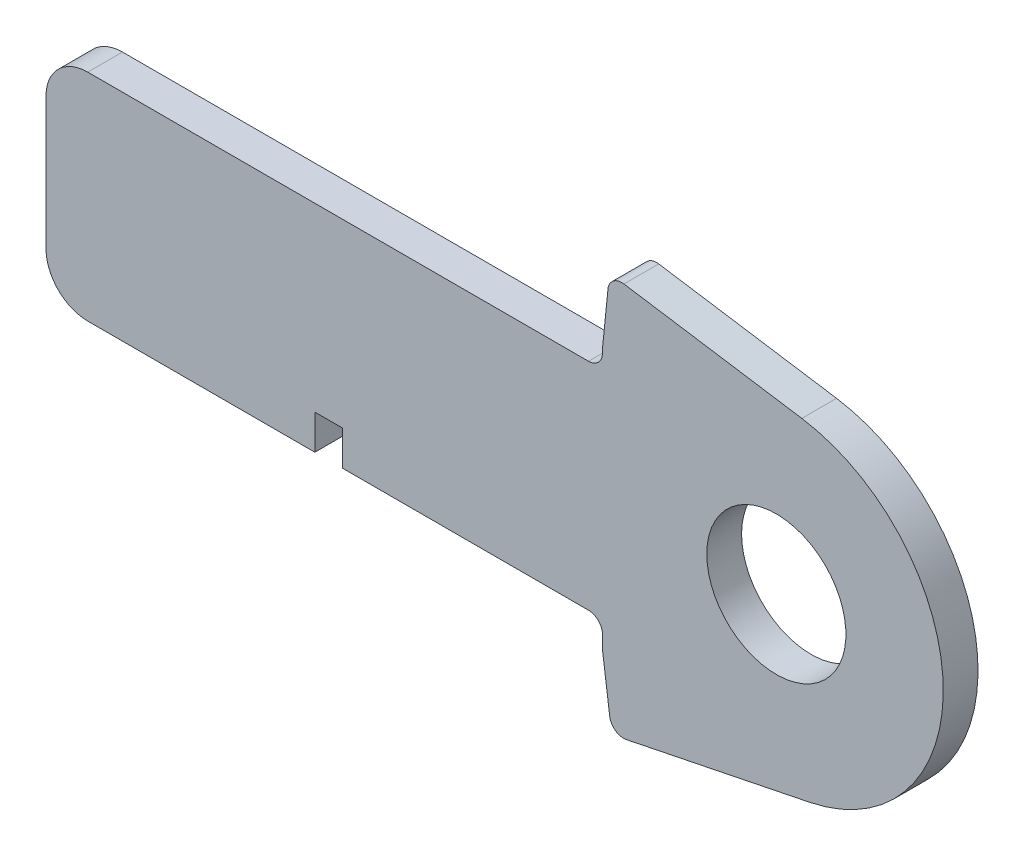
ISO-10303-21;
HEADER;
FILE_DESCRIPTION(('STEP AP214'),'2;1');
FILE_NAME('part.step','',(''),(''),'','','');
FILE_SCHEMA(('AUTOMOTIVE_DESIGN { 1 0 10303 214 1 1 1 1 }'));
ENDSEC;
DATA;
#1=APPLICATION_CONTEXT('core data for automotive mechanical design processes');
#2=APPLICATION_PROTOCOL_DEFINITION('international standard','automotive_design',2000,#1);
#3=PRODUCT_CONTEXT('',#1,'mechanical');
#4=PRODUCT('Part','Part','',(#3));
#5=PRODUCT_RELATED_PRODUCT_CATEGORY('part','',(#4));
#6=PRODUCT_DEFINITION_FORMATION('','',#4);
#7=PRODUCT_DEFINITION_CONTEXT('part definition',#1,'design');
#8=PRODUCT_DEFINITION('design','',#6,#7);
#9=PRODUCT_DEFINITION_SHAPE('','',#8);
#10=(LENGTH_UNIT() NAMED_UNIT(*) SI_UNIT(.MILLI.,.METRE.));
#11=(NAMED_UNIT(*) PLANE_ANGLE_UNIT() SI_UNIT($,.RADIAN.));
#12=(NAMED_UNIT(*) SI_UNIT($,.STERADIAN.) SOLID_ANGLE_UNIT());
#13=UNCERTAINTY_MEASURE_WITH_UNIT(LENGTH_MEASURE(1.E-05),#10,'distance_accuracy_value','');
#14=(GEOMETRIC_REPRESENTATION_CONTEXT(3) GLOBAL_UNCERTAINTY_ASSIGNED_CONTEXT((#13)) GLOBAL_UNIT_ASSIGNED_CONTEXT((#10,
#11,#12)) REPRESENTATION_CONTEXT('',''));
#15=CARTESIAN_POINT('',(0.,0.,0.));
#16=DIRECTION('',(0.,0.,1.));
#17=DIRECTION('',(1.,0.,0.));
#18=AXIS2_PLACEMENT_3D('',#15,#16,#17);
#19=CARTESIAN_POINT('',(213.422580288689,54.7287513036553,-3.175));
#20=DIRECTION('',(0.,0.,1.));
#21=DIRECTION('',(-1.,0.,0.));
#22=AXIS2_PLACEMENT_3D('',#19,#20,#21);
#23=PLANE('',#22);
#24=CARTESIAN_POINT('',(292.383806587551,26.255421434861,-3.175));
#25=DIRECTION('',(0.,0.,-1.));
#26=DIRECTION('',(-1.,0.,0.));
#27=AXIS2_PLACEMENT_3D('',#24,#25,#26);
#28=CIRCLE('',#27,6.35);
#29=CARTESIAN_POINT('',(286.033806587551,26.255421434861,-3.175));
#30=VERTEX_POINT('',#29);
#31=EDGE_CURVE('E276',#30,#30,#28,.T.);
#32=ORIENTED_EDGE('',*,*,#31,.F.);
#33=EDGE_LOOP('',(#32));
#34=FACE_BOUND('',#33,.T.);
#35=DIRECTION('',(-0.133331034869946,0.991071559041278,0.));
#36=VECTOR('',#35,1.);
#37=CARTESIAN_POINT('',(273.434595269181,36.7857570161253,-3.175));
#38=LINE('',#37,#36);
#39=CARTESIAN_POINT('',(277.174368657139,8.98740499943636,-3.175));
#40=VERTEX_POINT('',#39);
#41=CARTESIAN_POINT('',(276.508806587551,13.9346375667709,-3.175));
#42=VERTEX_POINT('',#41);
#43=EDGE_CURVE('E228',#40,#42,#38,.T.);
#44=ORIENTED_EDGE('',*,*,#43,.T.);
#45=DIRECTION('',(0.,1.,0.));
#46=VECTOR('',#45,1.);
#47=CARTESIAN_POINT('',(276.508806587551,0.,-3.175));
#48=LINE('',#47,#46);
#49=CARTESIAN_POINT('',(276.508806587551,15.142921434861,-3.175));
#50=VERTEX_POINT('',#49);
#51=EDGE_CURVE('E231',#42,#50,#48,.T.);
#52=ORIENTED_EDGE('',*,*,#51,.T.);
#53=CARTESIAN_POINT('',(275.238806587551,15.142921434861,-3.175));
#54=DIRECTION('',(0.,0.,-1.));
#55=DIRECTION('',(-1.,0.,0.));
#56=AXIS2_PLACEMENT_3D('',#53,#54,#55);
#57=CIRCLE('',#56,1.27);
#58=CARTESIAN_POINT('',(275.238806587551,16.412921434861,-3.175));
#59=VERTEX_POINT('',#58);
#60=EDGE_CURVE('E325',#59,#50,#57,.T.);
#61=ORIENTED_EDGE('',*,*,#60,.F.);
#62=DIRECTION('',(1.,0.,0.));
#63=VECTOR('',#62,1.);
#64=CARTESIAN_POINT('',(0.,16.412921434861,-3.175));
#65=LINE('',#64,#63);
#66=CARTESIAN_POINT('',(252.794440989192,16.412921434861,-3.175));
#67=VERTEX_POINT('',#66);
#68=EDGE_CURVE('E234',#67,#59,#65,.T.);
#69=ORIENTED_EDGE('',*,*,#68,.F.);
#70=DIRECTION('',(0.,-1.,0.));
#71=VECTOR('',#70,1.);
#72=CARTESIAN_POINT('',(252.794440989192,0.,-3.175));
#73=LINE('',#72,#71);
#74=CARTESIAN_POINT('',(252.794440989192,19.587921434861,-3.175));
#75=VERTEX_POINT('',#74);
#76=EDGE_CURVE('E185',#75,#67,#73,.T.);
#77=ORIENTED_EDGE('',*,*,#76,.F.);
#78=DIRECTION('',(1.,0.,0.));
#79=VECTOR('',#78,1.);
#80=CARTESIAN_POINT('',(0.,19.587921434861,-3.175));
#81=LINE('',#80,#79);
#82=CARTESIAN_POINT('',(250.254440989192,19.587921434861,-3.175));
#83=VERTEX_POINT('',#82);
#84=EDGE_CURVE('E239',#83,#75,#81,.T.);
#85=ORIENTED_EDGE('',*,*,#84,.F.);
#86=DIRECTION('',(0.,1.,0.));
#87=VECTOR('',#86,1.);
#88=CARTESIAN_POINT('',(250.254440989192,0.,-3.175));
#89=LINE('',#88,#87);
#90=CARTESIAN_POINT('',(250.254440989192,16.412921434861,-3.175));
#91=VERTEX_POINT('',#90);
#92=EDGE_CURVE('E242',#91,#83,#89,.T.);
#93=ORIENTED_EDGE('',*,*,#92,.F.);
#94=CARTESIAN_POINT('',(229.518806587551,16.412921434861,-3.175));
#95=VERTEX_POINT('',#94);
#96=EDGE_CURVE('E237',#95,#91,#65,.T.);
#97=ORIENTED_EDGE('',*,*,#96,.F.);
#98=CARTESIAN_POINT('',(229.518806587551,20.222921434861,-3.175));
#99=DIRECTION('',(0.,0.,-1.));
#100=DIRECTION('',(-1.,0.,0.));
#101=AXIS2_PLACEMENT_3D('',#98,#99,#100);
#102=CIRCLE('',#101,3.81);
#103=CARTESIAN_POINT('',(225.708806587551,20.222921434861,-3.175));
#104=VERTEX_POINT('',#103);
#105=EDGE_CURVE('E286',#104,#95,#102,.F.);
#106=ORIENTED_EDGE('',*,*,#105,.F.);
#107=DIRECTION('',(0.,-1.,0.));
#108=VECTOR('',#107,1.);
#109=CARTESIAN_POINT('',(225.708806587551,0.,-3.175));
#110=LINE('',#109,#108);
#111=CARTESIAN_POINT('',(225.708806587551,32.287921434861,-3.175));
#112=VERTEX_POINT('',#111);
#113=EDGE_CURVE('E245',#112,#104,#110,.T.);
#114=ORIENTED_EDGE('',*,*,#113,.F.);
#115=CARTESIAN_POINT('',(229.518806587551,32.287921434861,-3.175));
#116=DIRECTION('',(0.,0.,-1.));
#117=DIRECTION('',(-1.,0.,0.));
#118=AXIS2_PLACEMENT_3D('',#115,#116,#117);
#119=CIRCLE('',#118,3.81);
#120=CARTESIAN_POINT('',(229.518806587551,36.097921434861,-3.175));
#121=VERTEX_POINT('',#120);
#122=EDGE_CURVE('E283',#121,#112,#119,.F.);
#123=ORIENTED_EDGE('',*,*,#122,.F.);
#124=DIRECTION('',(1.,0.,0.));
#125=VECTOR('',#124,1.);
#126=CARTESIAN_POINT('',(0.,36.097921434861,-3.175));
#127=LINE('',#126,#125);
#128=CARTESIAN_POINT('',(275.238806587551,36.097921434861,-3.175));
#129=VERTEX_POINT('',#128);
#130=EDGE_CURVE('E248',#121,#129,#127,.T.);
#131=ORIENTED_EDGE('',*,*,#130,.T.);
#132=CARTESIAN_POINT('',(275.238806587551,37.367921434861,-3.175));
#133=DIRECTION('',(0.,0.,-1.));
#134=DIRECTION('',(-1.,0.,0.));
#135=AXIS2_PLACEMENT_3D('',#132,#133,#134);
#136=CIRCLE('',#135,1.27);
#137=CARTESIAN_POINT('',(276.508806587551,37.367921434861,-3.175));
#138=VERTEX_POINT('',#137);
#139=EDGE_CURVE('E49',#138,#129,#136,.T.);
#140=ORIENTED_EDGE('',*,*,#139,.F.);
#141=CARTESIAN_POINT('',(276.508806587551,37.7138591806421,-3.175));
#142=VERTEX_POINT('',#141);
#143=EDGE_CURVE('E235',#138,#142,#48,.T.);
#144=ORIENTED_EDGE('',*,*,#143,.T.);
#145=DIRECTION('',(0.10072544258434,0.994914260233609,0.));
#146=VECTOR('',#145,1.);
#147=CARTESIAN_POINT('',(269.924029023359,-27.3271962964349,-3.175));
#148=LINE('',#147,#146);
#149=CARTESIAN_POINT('',(277.013295568393,42.6969425833287,-3.175));
#150=VERTEX_POINT('',#149);
#151=EDGE_CURVE('E251',#142,#150,#148,.T.);
#152=ORIENTED_EDGE('',*,*,#151,.T.);
#153=CARTESIAN_POINT('',(278.27683667889,42.5690212712466,-3.175));
#154=DIRECTION('',(0.,0.,-1.));
#155=DIRECTION('',(-1.,0.,0.));
#156=AXIS2_PLACEMENT_3D('',#153,#154,#155);
#157=CIRCLE('',#156,1.27);
#158=CARTESIAN_POINT('',(278.470624311763,43.824149293938,-3.175));
#159=VERTEX_POINT('',#158);
#160=EDGE_CURVE('E301',#159,#150,#157,.F.);
#161=ORIENTED_EDGE('',*,*,#160,.F.);
#162=DIRECTION('',(0.988289781646758,-0.152588687302186,0.));
#163=VECTOR('',#162,1.);
#164=CARTESIAN_POINT('',(13.0924795434369,84.7976608093711,-3.175));
#165=LINE('',#164,#163);
#166=CARTESIAN_POINT('',(294.709258182036,41.3169577071576,-3.175));
#167=VERTEX_POINT('',#166);
#168=EDGE_CURVE('E254',#159,#167,#165,.T.);
#169=ORIENTED_EDGE('',*,*,#168,.T.);
#170=CARTESIAN_POINT('',(292.383806587551,26.255421434861,-3.175));
#171=DIRECTION('',(0.,0.,1.));
#172=DIRECTION('',(1.,0.,0.));
#173=AXIS2_PLACEMENT_3D('',#170,#171,#172);
#174=CIRCLE('',#173,15.24);
#175=CARTESIAN_POINT('',(295.425747265751,11.3220963895031,-3.175));
#176=VERTEX_POINT('',#175);
#177=EDGE_CURVE('E257',#176,#167,#174,.T.);
#178=ORIENTED_EDGE('',*,*,#177,.F.);
#179=DIRECTION('',(0.979876971480177,0.199602406706023,0.));
#180=VECTOR('',#179,1.);
#181=CARTESIAN_POINT('',(9.55565157305778,-46.9100702664279,-3.175));
#182=LINE('',#181,#180);
#183=CARTESIAN_POINT('',(278.686524593638,7.91229165994138,-3.175));
#184=VERTEX_POINT('',#183);
#185=EDGE_CURVE('E225',#184,#176,#182,.T.);
#186=ORIENTED_EDGE('',*,*,#185,.F.);
#187=CARTESIAN_POINT('',(278.433029537121,9.15673541372118,-3.175));
#188=DIRECTION('',(0.,0.,-1.));
#189=DIRECTION('',(-1.,0.,0.));
#190=AXIS2_PLACEMENT_3D('',#187,#188,#189);
#191=CIRCLE('',#190,1.27);
#192=EDGE_CURVE('E304',#40,#184,#191,.F.);
#193=ORIENTED_EDGE('',*,*,#192,.F.);
#194=EDGE_LOOP('',(#44,#52,#61,#69,#77,#85,#93,#97,#106,#114,#123,#131,#140,#144,#152,#161,#169,
#178,#186,#193));
#195=FACE_BOUND('',#194,.T.);
#196=ADVANCED_FACE('F41',(#34,#195),#23,.F.);
#197=CARTESIAN_POINT('',(213.422580288689,54.7287513036553,0.));
#198=DIRECTION('',(0.,0.,1.));
#199=DIRECTION('',(-1.,0.,0.));
#200=AXIS2_PLACEMENT_3D('',#197,#198,#199);
#201=PLANE('',#200);
#202=CARTESIAN_POINT('',(292.383806587551,26.255421434861,0.));
#203=DIRECTION('',(0.,0.,-1.));
#204=DIRECTION('',(-1.,0.,0.));
#205=AXIS2_PLACEMENT_3D('',#202,#203,#204);
#206=CIRCLE('',#205,6.35);
#207=CARTESIAN_POINT('',(286.033806587551,26.255421434861,0.));
#208=VERTEX_POINT('',#207);
#209=EDGE_CURVE('E263',#208,#208,#206,.T.);
#210=ORIENTED_EDGE('',*,*,#209,.T.);
#211=EDGE_LOOP('',(#210));
#212=FACE_BOUND('',#211,.T.);
#213=DIRECTION('',(0.979876971480177,0.199602406706023,0.));
#214=VECTOR('',#213,1.);
#215=CARTESIAN_POINT('',(9.55565157305778,-46.9100702664279,0.));
#216=LINE('',#215,#214);
#217=CARTESIAN_POINT('',(278.686524593638,7.91229165994138,0.));
#218=VERTEX_POINT('',#217);
#219=CARTESIAN_POINT('',(295.425747265751,11.3220963895031,0.));
#220=VERTEX_POINT('',#219);
#221=EDGE_CURVE('E260',#218,#220,#216,.T.);
#222=ORIENTED_EDGE('',*,*,#221,.T.);
#223=CARTESIAN_POINT('',(292.383806587551,26.255421434861,0.));
#224=DIRECTION('',(0.,0.,1.));
#225=DIRECTION('',(1.,0.,0.));
#226=AXIS2_PLACEMENT_3D('',#223,#224,#225);
#227=CIRCLE('',#226,15.24);
#228=CARTESIAN_POINT('',(294.709258182036,41.3169577071576,0.));
#229=VERTEX_POINT('',#228);
#230=EDGE_CURVE('E222',#220,#229,#227,.T.);
#231=ORIENTED_EDGE('',*,*,#230,.T.);
#232=DIRECTION('',(0.988289781646758,-0.152588687302186,0.));
#233=VECTOR('',#232,1.);
#234=CARTESIAN_POINT('',(13.0924795434369,84.7976608093711,0.));
#235=LINE('',#234,#233);
#236=CARTESIAN_POINT('',(278.470624311763,43.824149293938,0.));
#237=VERTEX_POINT('',#236);
#238=EDGE_CURVE('E219',#237,#229,#235,.T.);
#239=ORIENTED_EDGE('',*,*,#238,.F.);
#240=CARTESIAN_POINT('',(278.27683667889,42.5690212712466,0.));
#241=DIRECTION('',(0.,0.,-1.));
#242=DIRECTION('',(-1.,0.,0.));
#243=AXIS2_PLACEMENT_3D('',#240,#241,#242);
#244=CIRCLE('',#243,1.27);
#245=CARTESIAN_POINT('',(277.013295568393,42.6969425833287,0.));
#246=VERTEX_POINT('',#245);
#247=EDGE_CURVE('E309',#246,#237,#244,.T.);
#248=ORIENTED_EDGE('',*,*,#247,.F.);
#249=DIRECTION('',(0.10072544258434,0.994914260233609,0.));
#250=VECTOR('',#249,1.);
#251=CARTESIAN_POINT('',(269.924029023359,-27.3271962964349,0.));
#252=LINE('',#251,#250);
#253=CARTESIAN_POINT('',(276.508806587551,37.7138591806421,0.));
#254=VERTEX_POINT('',#253);
#255=EDGE_CURVE('E216',#254,#246,#252,.T.);
#256=ORIENTED_EDGE('',*,*,#255,.F.);
#257=DIRECTION('',(0.,1.,0.));
#258=VECTOR('',#257,1.);
#259=CARTESIAN_POINT('',(276.508806587551,0.,0.));
#260=LINE('',#259,#258);
#261=CARTESIAN_POINT('',(276.508806587551,37.367921434861,0.));
#262=VERTEX_POINT('',#261);
#263=EDGE_CURVE('E215',#262,#254,#260,.T.);
#264=ORIENTED_EDGE('',*,*,#263,.F.);
#265=CARTESIAN_POINT('',(275.238806587551,37.367921434861,0.));
#266=DIRECTION('',(0.,0.,-1.));
#267=DIRECTION('',(-1.,0.,0.));
#268=AXIS2_PLACEMENT_3D('',#265,#266,#267);
#269=CIRCLE('',#268,1.27);
#270=CARTESIAN_POINT('',(275.238806587551,36.097921434861,0.));
#271=VERTEX_POINT('',#270);
#272=EDGE_CURVE('E11',#271,#262,#269,.F.);
#273=ORIENTED_EDGE('',*,*,#272,.F.);
#274=DIRECTION('',(1.,0.,0.));
#275=VECTOR('',#274,1.);
#276=CARTESIAN_POINT('',(0.,36.097921434861,0.));
#277=LINE('',#276,#275);
#278=CARTESIAN_POINT('',(229.518806587551,36.097921434861,0.));
#279=VERTEX_POINT('',#278);
#280=EDGE_CURVE('E212',#279,#271,#277,.T.);
#281=ORIENTED_EDGE('',*,*,#280,.F.);
#282=CARTESIAN_POINT('',(229.518806587551,32.287921434861,0.));
#283=DIRECTION('',(0.,0.,-1.));
#284=DIRECTION('',(-1.,0.,0.));
#285=AXIS2_PLACEMENT_3D('',#282,#283,#284);
#286=CIRCLE('',#285,3.81);
#287=CARTESIAN_POINT('',(225.708806587551,32.287921434861,0.));
#288=VERTEX_POINT('',#287);
#289=EDGE_CURVE('E291',#288,#279,#286,.T.);
#290=ORIENTED_EDGE('',*,*,#289,.F.);
#291=DIRECTION('',(0.,-1.,0.));
#292=VECTOR('',#291,1.);
#293=CARTESIAN_POINT('',(225.708806587551,0.,0.));
#294=LINE('',#293,#292);
#295=CARTESIAN_POINT('',(225.708806587551,20.222921434861,0.));
#296=VERTEX_POINT('',#295);
#297=EDGE_CURVE('E209',#288,#296,#294,.T.);
#298=ORIENTED_EDGE('',*,*,#297,.T.);
#299=CARTESIAN_POINT('',(229.518806587551,20.222921434861,0.));
#300=DIRECTION('',(0.,0.,-1.));
#301=DIRECTION('',(-1.,0.,0.));
#302=AXIS2_PLACEMENT_3D('',#299,#300,#301);
#303=CIRCLE('',#302,3.81);
#304=CARTESIAN_POINT('',(229.518806587551,16.412921434861,0.));
#305=VERTEX_POINT('',#304);
#306=EDGE_CURVE('E294',#305,#296,#303,.T.);
#307=ORIENTED_EDGE('',*,*,#306,.F.);
#308=DIRECTION('',(1.,0.,0.));
#309=VECTOR('',#308,1.);
#310=CARTESIAN_POINT('',(0.,16.412921434861,0.));
#311=LINE('',#310,#309);
#312=CARTESIAN_POINT('',(250.254440989192,16.412921434861,0.));
#313=VERTEX_POINT('',#312);
#314=EDGE_CURVE('E197',#305,#313,#311,.T.);
#315=ORIENTED_EDGE('',*,*,#314,.T.);
#316=DIRECTION('',(0.,1.,0.));
#317=VECTOR('',#316,1.);
#318=CARTESIAN_POINT('',(250.254440989192,0.,0.));
#319=LINE('',#318,#317);
#320=CARTESIAN_POINT('',(250.254440989192,19.587921434861,0.));
#321=VERTEX_POINT('',#320);
#322=EDGE_CURVE('E204',#313,#321,#319,.T.);
#323=ORIENTED_EDGE('',*,*,#322,.T.);
#324=DIRECTION('',(1.,0.,0.));
#325=VECTOR('',#324,1.);
#326=CARTESIAN_POINT('',(0.,19.587921434861,0.));
#327=LINE('',#326,#325);
#328=CARTESIAN_POINT('',(252.794440989192,19.587921434861,0.));
#329=VERTEX_POINT('',#328);
#330=EDGE_CURVE('E202',#321,#329,#327,.T.);
#331=ORIENTED_EDGE('',*,*,#330,.T.);
#332=DIRECTION('',(0.,-1.,0.));
#333=VECTOR('',#332,1.);
#334=CARTESIAN_POINT('',(252.794440989192,0.,0.));
#335=LINE('',#334,#333);
#336=CARTESIAN_POINT('',(252.794440989192,16.412921434861,0.));
#337=VERTEX_POINT('',#336);
#338=EDGE_CURVE('E182',#329,#337,#335,.T.);
#339=ORIENTED_EDGE('',*,*,#338,.T.);
#340=CARTESIAN_POINT('',(275.238806587551,16.412921434861,0.));
#341=VERTEX_POINT('',#340);
#342=EDGE_CURVE('E191',#337,#341,#311,.T.);
#343=ORIENTED_EDGE('',*,*,#342,.T.);
#344=CARTESIAN_POINT('',(275.238806587551,15.142921434861,0.));
#345=DIRECTION('',(0.,0.,-1.));
#346=DIRECTION('',(-1.,0.,0.));
#347=AXIS2_PLACEMENT_3D('',#344,#345,#346);
#348=CIRCLE('',#347,1.27);
#349=CARTESIAN_POINT('',(276.508806587551,15.142921434861,0.));
#350=VERTEX_POINT('',#349);
#351=EDGE_CURVE('E327',#350,#341,#348,.F.);
#352=ORIENTED_EDGE('',*,*,#351,.F.);
#353=CARTESIAN_POINT('',(276.508806587551,13.9346375667709,0.));
#354=VERTEX_POINT('',#353);
#355=EDGE_CURVE('E195',#354,#350,#260,.T.);
#356=ORIENTED_EDGE('',*,*,#355,.F.);
#357=DIRECTION('',(-0.133331034869946,0.991071559041278,0.));
#358=VECTOR('',#357,1.);
#359=CARTESIAN_POINT('',(273.434595269181,36.7857570161253,0.));
#360=LINE('',#359,#358);
#361=CARTESIAN_POINT('',(277.174368657139,8.98740499943636,0.));
#362=VERTEX_POINT('',#361);
#363=EDGE_CURVE('E348',#362,#354,#360,.T.);
#364=ORIENTED_EDGE('',*,*,#363,.F.);
#365=CARTESIAN_POINT('',(278.433029537121,9.15673541372118,0.));
#366=DIRECTION('',(0.,0.,-1.));
#367=DIRECTION('',(-1.,0.,0.));
#368=AXIS2_PLACEMENT_3D('',#365,#366,#367);
#369=CIRCLE('',#368,1.27);
#370=EDGE_CURVE('E312',#218,#362,#369,.T.);
#371=ORIENTED_EDGE('',*,*,#370,.F.);
#372=EDGE_LOOP('',(#222,#231,#239,#248,#256,#264,#273,#281,#290,#298,#307,#315,#323,#331,#339,
#343,#352,#356,#364,#371));
#373=FACE_BOUND('',#372,.T.);
#374=ADVANCED_FACE('F199',(#212,#373),#201,.T.);
#375=CARTESIAN_POINT('',(292.383806587551,26.255421434861,-7.62));
#376=DIRECTION('',(0.,0.,1.));
#377=DIRECTION('',(-1.,0.,0.));
#378=AXIS2_PLACEMENT_3D('',#375,#376,#377);
#379=CYLINDRICAL_SURFACE('',#378,6.35);
#380=CARTESIAN_POINT('',(286.033806587551,26.255421434861,0.));
#381=CARTESIAN_POINT('',(286.033806587551,26.255421434861,-0.0330729166666668));
#382=CARTESIAN_POINT('',(286.033806587551,26.255421434861,-0.0661458333333336));
#383=CARTESIAN_POINT('',(286.033806587551,26.255421434861,-0.132291666666667));
#384=CARTESIAN_POINT('',(286.033806587551,26.255421434861,-0.165364583333333));
#385=CARTESIAN_POINT('',(286.033806587551,26.255421434861,-0.231510416666667));
#386=CARTESIAN_POINT('',(286.033806587551,26.255421434861,-0.264583333333333));
#387=CARTESIAN_POINT('',(286.033806587551,26.255421434861,-0.330729166666667));
#388=CARTESIAN_POINT('',(286.033806587551,26.255421434861,-0.363802083333333));
#389=CARTESIAN_POINT('',(286.033806587551,26.255421434861,-0.429947916666666));
#390=CARTESIAN_POINT('',(286.033806587551,26.255421434861,-0.463020833333333));
#391=CARTESIAN_POINT('',(286.033806587551,26.255421434861,-0.529166666666666));
#392=CARTESIAN_POINT('',(286.033806587551,26.255421434861,-0.562239583333333));
#393=CARTESIAN_POINT('',(286.033806587551,26.255421434861,-0.628385416666666));
#394=CARTESIAN_POINT('',(286.033806587551,26.255421434861,-0.661458333333333));
#395=CARTESIAN_POINT('',(286.033806587551,26.255421434861,-0.727604166666666));
#396=CARTESIAN_POINT('',(286.033806587551,26.255421434861,-0.760677083333333));
#397=CARTESIAN_POINT('',(286.033806587551,26.255421434861,-0.826822916666666));
#398=CARTESIAN_POINT('',(286.033806587551,26.255421434861,-0.859895833333333));
#399=CARTESIAN_POINT('',(286.033806587551,26.255421434861,-0.926041666666666));
#400=CARTESIAN_POINT('',(286.033806587551,26.255421434861,-0.959114583333333));
#401=CARTESIAN_POINT('',(286.033806587551,26.255421434861,-1.02526041666667));
#402=CARTESIAN_POINT('',(286.033806587551,26.255421434861,-1.05833333333333));
#403=CARTESIAN_POINT('',(286.033806587551,26.255421434861,-1.12447916666667));
#404=CARTESIAN_POINT('',(286.033806587551,26.255421434861,-1.15755208333333));
#405=CARTESIAN_POINT('',(286.033806587551,26.255421434861,-1.22369791666667));
#406=CARTESIAN_POINT('',(286.033806587551,26.255421434861,-1.25677083333333));
#407=CARTESIAN_POINT('',(286.033806587551,26.255421434861,-1.32291666666667));
#408=CARTESIAN_POINT('',(286.033806587551,26.255421434861,-1.35598958333333));
#409=CARTESIAN_POINT('',(286.033806587551,26.255421434861,-1.42213541666667));
#410=CARTESIAN_POINT('',(286.033806587551,26.255421434861,-1.45520833333333));
#411=CARTESIAN_POINT('',(286.033806587551,26.255421434861,-1.52135416666667));
#412=CARTESIAN_POINT('',(286.033806587551,26.255421434861,-1.55442708333333));
#413=CARTESIAN_POINT('',(286.033806587551,26.255421434861,-1.62057291666667));
#414=CARTESIAN_POINT('',(286.033806587551,26.255421434861,-1.65364583333333));
#415=CARTESIAN_POINT('',(286.033806587551,26.255421434861,-1.71979166666667));
#416=CARTESIAN_POINT('',(286.033806587551,26.255421434861,-1.75286458333333));
#417=CARTESIAN_POINT('',(286.033806587551,26.255421434861,-1.81901041666667));
#418=CARTESIAN_POINT('',(286.033806587551,26.255421434861,-1.85208333333333));
#419=CARTESIAN_POINT('',(286.033806587551,26.255421434861,-1.91822916666667));
#420=CARTESIAN_POINT('',(286.033806587551,26.255421434861,-1.95130208333333));
#421=CARTESIAN_POINT('',(286.033806587551,26.255421434861,-2.01744791666667));
#422=CARTESIAN_POINT('',(286.033806587551,26.255421434861,-2.05052083333333));
#423=CARTESIAN_POINT('',(286.033806587551,26.255421434861,-2.11666666666667));
#424=CARTESIAN_POINT('',(286.033806587551,26.255421434861,-2.14973958333333));
#425=CARTESIAN_POINT('',(286.033806587551,26.255421434861,-2.21588541666667));
#426=CARTESIAN_POINT('',(286.033806587551,26.255421434861,-2.24895833333333));
#427=CARTESIAN_POINT('',(286.033806587551,26.255421434861,-2.31510416666667));
#428=CARTESIAN_POINT('',(286.033806587551,26.255421434861,-2.34817708333333));
#429=CARTESIAN_POINT('',(286.033806587551,26.255421434861,-2.41432291666667));
#430=CARTESIAN_POINT('',(286.033806587551,26.255421434861,-2.44739583333333));
#431=CARTESIAN_POINT('',(286.033806587551,26.255421434861,-2.51354166666667));
#432=CARTESIAN_POINT('',(286.033806587551,26.255421434861,-2.54661458333333));
#433=CARTESIAN_POINT('',(286.033806587551,26.255421434861,-2.61276041666667));
#434=CARTESIAN_POINT('',(286.033806587551,26.255421434861,-2.64583333333333));
#435=CARTESIAN_POINT('',(286.033806587551,26.255421434861,-2.71197916666667));
#436=CARTESIAN_POINT('',(286.033806587551,26.255421434861,-2.74505208333333));
#437=CARTESIAN_POINT('',(286.033806587551,26.255421434861,-2.81119791666667));
#438=CARTESIAN_POINT('',(286.033806587551,26.255421434861,-2.84427083333333));
#439=CARTESIAN_POINT('',(286.033806587551,26.255421434861,-2.91041666666667));
#440=CARTESIAN_POINT('',(286.033806587551,26.255421434861,-2.94348958333333));
#441=CARTESIAN_POINT('',(286.033806587551,26.255421434861,-3.00963541666667));
#442=CARTESIAN_POINT('',(286.033806587551,26.255421434861,-3.04270833333333));
#443=CARTESIAN_POINT('',(286.033806587551,26.255421434861,-3.10885416666667));
#444=CARTESIAN_POINT('',(286.033806587551,26.255421434861,-3.14192708333333));
#445=CARTESIAN_POINT('',(286.033806587551,26.255421434861,-3.175));
#446=B_SPLINE_CURVE_WITH_KNOTS('',3,(#380,#381,#382,#383,#384,#385,#386,#387,#388,#389,#390,
#391,#392,#393,#394,#395,#396,#397,#398,#399,#400,#401,#402,#403,#404,#405,#406,#407,#408,#409,
#410,#411,#412,#413,#414,#415,#416,#417,#418,#419,#420,#421,#422,#423,#424,#425,#426,#427,#428,
#429,#430,#431,#432,#433,#434,#435,#436,#437,#438,#439,#440,#441,#442,#443,#444,#445),
.UNSPECIFIED.,.F.,.F.,(4,2,2,2,2,2,2,2,2,2,2,2,2,2,2,2,2,2,2,2,2,2,2,2,2,2,2,2,2,2,2,2,4),(0.,
0.0992187500000004,0.1984375,0.29765625,0.396875,0.49609375,0.595312499999999,0.69453125,
0.793749999999999,0.89296875,0.9921875,1.09140625,1.190625,1.28984375,1.3890625,1.48828125,
1.5875,1.68671875,1.7859375,1.88515625,1.984375,2.08359375,2.1828125,2.28203125,2.38125,
2.48046875,2.5796875,2.67890625,2.778125,2.87734375,2.9765625,3.07578125,3.175),.UNSPECIFIED.);
#447=EDGE_CURVE('BSEAM396',#208,#30,#446,.T.);
#448=ORIENTED_EDGE('',*,*,#209,.F.);
#449=ORIENTED_EDGE('',*,*,#31,.T.);
#450=ORIENTED_EDGE('',*,*,#447,.T.);
#451=ORIENTED_EDGE('',*,*,#447,.F.);
#452=EDGE_LOOP('',(#448,#450,#449,#451));
#453=FACE_BOUND('',#452,.T.);
#454=ADVANCED_FACE('F396',(#453),#379,.F.);
#455=CARTESIAN_POINT('',(9.55565157305778,-46.9100702664279,0.));
#456=DIRECTION('',(0.199602406706023,-0.979876971480177,0.));
#457=DIRECTION('',(0.979876971480177,0.199602406706023,0.));
#458=AXIS2_PLACEMENT_3D('',#455,#456,#457);
#459=PLANE('',#458);
#460=ORIENTED_EDGE('',*,*,#185,.T.);
#461=DIRECTION('',(0.,0.,-1.));
#462=VECTOR('',#461,1.);
#463=CARTESIAN_POINT('',(295.425747265751,11.3220963895031,0.));
#464=LINE('',#463,#462);
#465=EDGE_CURVE('E261',#220,#176,#464,.T.);
#466=ORIENTED_EDGE('',*,*,#465,.F.);
#467=ORIENTED_EDGE('',*,*,#221,.F.);
#468=DIRECTION('',(0.,0.,-1.));
#469=VECTOR('',#468,1.);
#470=CARTESIAN_POINT('',(278.686524593638,7.91229165994136,0.));
#471=LINE('',#470,#469);
#472=EDGE_CURVE('E307',#184,#218,#471,.F.);
#473=ORIENTED_EDGE('',*,*,#472,.F.);
#474=EDGE_LOOP('',(#460,#466,#467,#473));
#475=FACE_BOUND('',#474,.T.);
#476=ADVANCED_FACE('F360',(#475),#459,.T.);
#477=CARTESIAN_POINT('',(292.383806587551,26.255421434861,0.));
#478=DIRECTION('',(0.,0.,-1.));
#479=DIRECTION('',(1.,0.,0.));
#480=AXIS2_PLACEMENT_3D('',#477,#478,#479);
#481=CYLINDRICAL_SURFACE('',#480,15.24);
#482=ORIENTED_EDGE('',*,*,#177,.T.);
#483=DIRECTION('',(0.,0.,-1.));
#484=VECTOR('',#483,1.);
#485=CARTESIAN_POINT('',(294.709258182036,41.3169577071576,0.));
#486=LINE('',#485,#484);
#487=EDGE_CURVE('E264',#229,#167,#486,.T.);
#488=ORIENTED_EDGE('',*,*,#487,.F.);
#489=ORIENTED_EDGE('',*,*,#230,.F.);
#490=ORIENTED_EDGE('',*,*,#465,.T.);
#491=EDGE_LOOP('',(#482,#488,#489,#490));
#492=FACE_BOUND('',#491,.T.);
#493=ADVANCED_FACE('F364',(#492),#481,.T.);
#494=CARTESIAN_POINT('',(13.0924795434369,84.7976608093711,0.));
#495=DIRECTION('',(-0.152588687302185,-0.988289781646758,0.));
#496=DIRECTION('',(0.988289781646758,-0.152588687302186,0.));
#497=AXIS2_PLACEMENT_3D('',#494,#495,#496);
#498=PLANE('',#497);
#499=ORIENTED_EDGE('',*,*,#238,.T.);
#500=ORIENTED_EDGE('',*,*,#487,.T.);
#501=ORIENTED_EDGE('',*,*,#168,.F.);
#502=DIRECTION('',(0.,0.,-1.));
#503=VECTOR('',#502,1.);
#504=CARTESIAN_POINT('',(278.470624311763,43.824149293938,0.));
#505=LINE('',#504,#503);
#506=EDGE_CURVE('E315',#237,#159,#505,.T.);
#507=ORIENTED_EDGE('',*,*,#506,.F.);
#508=EDGE_LOOP('',(#499,#500,#501,#507));
#509=FACE_BOUND('',#508,.T.);
#510=ADVANCED_FACE('F367',(#509),#498,.F.);
#511=CARTESIAN_POINT('',(269.924029023359,-27.3271962964349,0.));
#512=DIRECTION('',(0.994914260233609,-0.10072544258434,0.));
#513=DIRECTION('',(0.10072544258434,0.994914260233609,0.));
#514=AXIS2_PLACEMENT_3D('',#511,#512,#513);
#515=PLANE('',#514);
#516=ORIENTED_EDGE('',*,*,#151,.F.);
#517=DIRECTION('',(0.,0.,-1.));
#518=VECTOR('',#517,1.);
#519=CARTESIAN_POINT('',(276.508806587551,37.7138591806421,0.));
#520=LINE('',#519,#518);
#521=EDGE_CURVE('E266',#254,#142,#520,.T.);
#522=ORIENTED_EDGE('',*,*,#521,.F.);
#523=ORIENTED_EDGE('',*,*,#255,.T.);
#524=DIRECTION('',(0.,0.,-1.));
#525=VECTOR('',#524,1.);
#526=CARTESIAN_POINT('',(277.013295568393,42.6969425833287,0.));
#527=LINE('',#526,#525);
#528=EDGE_CURVE('E317',#150,#246,#527,.F.);
#529=ORIENTED_EDGE('',*,*,#528,.F.);
#530=EDGE_LOOP('',(#516,#522,#523,#529));
#531=FACE_BOUND('',#530,.T.);
#532=ADVANCED_FACE('F373',(#531),#515,.F.);
#533=CARTESIAN_POINT('',(276.508806587551,0.,0.));
#534=DIRECTION('',(1.,0.,0.));
#535=DIRECTION('',(0.,0.,1.));
#536=AXIS2_PLACEMENT_3D('',#533,#534,#535);
#537=PLANE('',#536);
#538=ORIENTED_EDGE('',*,*,#263,.T.);
#539=ORIENTED_EDGE('',*,*,#521,.T.);
#540=ORIENTED_EDGE('',*,*,#143,.F.);
#541=DIRECTION('',(0.,0.,-1.));
#542=VECTOR('',#541,1.);
#543=CARTESIAN_POINT('',(276.508806587551,37.367921434861,-3.175));
#544=LINE('',#543,#542);
#545=EDGE_CURVE('E321',#262,#138,#544,.T.);
#546=ORIENTED_EDGE('',*,*,#545,.F.);
#547=EDGE_LOOP('',(#538,#539,#540,#546));
#548=FACE_BOUND('',#547,.T.);
#549=ADVANCED_FACE('F374',(#548),#537,.F.);
#550=CARTESIAN_POINT('',(0.,36.097921434861,0.));
#551=DIRECTION('',(0.,-1.,0.));
#552=DIRECTION('',(0.,0.,1.));
#553=AXIS2_PLACEMENT_3D('',#550,#551,#552);
#554=PLANE('',#553);
#555=ORIENTED_EDGE('',*,*,#130,.F.);
#556=DIRECTION('',(0.,0.,-1.));
#557=VECTOR('',#556,1.);
#558=CARTESIAN_POINT('',(229.518806587551,36.097921434861,-3.175));
#559=LINE('',#558,#557);
#560=EDGE_CURVE('E297',#279,#121,#559,.T.);
#561=ORIENTED_EDGE('',*,*,#560,.F.);
#562=ORIENTED_EDGE('',*,*,#280,.T.);
#563=DIRECTION('',(0.,0.,-1.));
#564=VECTOR('',#563,1.);
#565=CARTESIAN_POINT('',(275.238806587551,36.097921434861,0.));
#566=LINE('',#565,#564);
#567=EDGE_CURVE('E323',#129,#271,#566,.F.);
#568=ORIENTED_EDGE('',*,*,#567,.F.);
#569=EDGE_LOOP('',(#555,#561,#562,#568));
#570=FACE_BOUND('',#569,.T.);
#571=ADVANCED_FACE('F338',(#570),#554,.F.);
#572=CARTESIAN_POINT('',(225.708806587551,0.,0.));
#573=DIRECTION('',(-1.,0.,0.));
#574=DIRECTION('',(0.,0.,-1.));
#575=AXIS2_PLACEMENT_3D('',#572,#573,#574);
#576=PLANE('',#575);
#577=ORIENTED_EDGE('',*,*,#297,.F.);
#578=DIRECTION('',(0.,0.,-1.));
#579=VECTOR('',#578,1.);
#580=CARTESIAN_POINT('',(225.708806587551,32.287921434861,0.));
#581=LINE('',#580,#579);
#582=EDGE_CURVE('E279',#112,#288,#581,.F.);
#583=ORIENTED_EDGE('',*,*,#582,.F.);
#584=ORIENTED_EDGE('',*,*,#113,.T.);
#585=DIRECTION('',(0.,0.,-1.));
#586=VECTOR('',#585,1.);
#587=CARTESIAN_POINT('',(225.708806587551,20.222921434861,0.));
#588=LINE('',#587,#586);
#589=EDGE_CURVE('E281',#296,#104,#588,.T.);
#590=ORIENTED_EDGE('',*,*,#589,.F.);
#591=EDGE_LOOP('',(#577,#583,#584,#590));
#592=FACE_BOUND('',#591,.T.);
#593=ADVANCED_FACE('F513',(#592),#576,.T.);
#594=CARTESIAN_POINT('',(0.,16.412921434861,0.));
#595=DIRECTION('',(0.,-1.,0.));
#596=DIRECTION('',(1.,0.,0.));
#597=AXIS2_PLACEMENT_3D('',#594,#595,#596);
#598=PLANE('',#597);
#599=ORIENTED_EDGE('',*,*,#96,.T.);
#600=DIRECTION('',(0.,0.,-1.));
#601=VECTOR('',#600,1.);
#602=CARTESIAN_POINT('',(250.254440989192,16.412921434861,0.));
#603=LINE('',#602,#601);
#604=EDGE_CURVE('E268',#313,#91,#603,.T.);
#605=ORIENTED_EDGE('',*,*,#604,.F.);
#606=ORIENTED_EDGE('',*,*,#314,.F.);
#607=DIRECTION('',(0.,0.,-1.));
#608=VECTOR('',#607,1.);
#609=CARTESIAN_POINT('',(229.518806587551,16.412921434861,0.));
#610=LINE('',#609,#608);
#611=EDGE_CURVE('E289',#95,#305,#610,.F.);
#612=ORIENTED_EDGE('',*,*,#611,.F.);
#613=EDGE_LOOP('',(#599,#605,#606,#612));
#614=FACE_BOUND('',#613,.T.);
#615=ADVANCED_FACE('F477',(#614),#598,.T.);
#616=CARTESIAN_POINT('',(250.254440989192,0.,0.));
#617=DIRECTION('',(1.,0.,0.));
#618=DIRECTION('',(0.,0.,1.));
#619=AXIS2_PLACEMENT_3D('',#616,#617,#618);
#620=PLANE('',#619);
#621=ORIENTED_EDGE('',*,*,#92,.T.);
#622=DIRECTION('',(0.,0.,-1.));
#623=VECTOR('',#622,1.);
#624=CARTESIAN_POINT('',(250.254440989192,19.587921434861,0.));
#625=LINE('',#624,#623);
#626=EDGE_CURVE('E270',#321,#83,#625,.T.);
#627=ORIENTED_EDGE('',*,*,#626,.F.);
#628=ORIENTED_EDGE('',*,*,#322,.F.);
#629=ORIENTED_EDGE('',*,*,#604,.T.);
#630=EDGE_LOOP('',(#621,#627,#628,#629));
#631=FACE_BOUND('',#630,.T.);
#632=ADVANCED_FACE('F494',(#631),#620,.T.);
#633=CARTESIAN_POINT('',(0.,19.587921434861,0.));
#634=DIRECTION('',(0.,-1.,0.));
#635=DIRECTION('',(0.,0.,1.));
#636=AXIS2_PLACEMENT_3D('',#633,#634,#635);
#637=PLANE('',#636);
#638=ORIENTED_EDGE('',*,*,#84,.T.);
#639=DIRECTION('',(0.,0.,-1.));
#640=VECTOR('',#639,1.);
#641=CARTESIAN_POINT('',(252.794440989192,19.587921434861,0.));
#642=LINE('',#641,#640);
#643=EDGE_CURVE('E187',#329,#75,#642,.T.);
#644=ORIENTED_EDGE('',*,*,#643,.F.);
#645=ORIENTED_EDGE('',*,*,#330,.F.);
#646=ORIENTED_EDGE('',*,*,#626,.T.);
#647=EDGE_LOOP('',(#638,#644,#645,#646));
#648=FACE_BOUND('',#647,.T.);
#649=ADVANCED_FACE('F485',(#648),#637,.T.);
#650=CARTESIAN_POINT('',(252.794440989192,0.,0.));
#651=DIRECTION('',(-1.,0.,0.));
#652=DIRECTION('',(0.,0.,-1.));
#653=AXIS2_PLACEMENT_3D('',#650,#651,#652);
#654=PLANE('',#653);
#655=ORIENTED_EDGE('',*,*,#76,.T.);
#656=DIRECTION('',(0.,0.,-1.));
#657=VECTOR('',#656,1.);
#658=CARTESIAN_POINT('',(252.794440989192,16.412921434861,0.));
#659=LINE('',#658,#657);
#660=EDGE_CURVE('E179',#337,#67,#659,.T.);
#661=ORIENTED_EDGE('',*,*,#660,.F.);
#662=ORIENTED_EDGE('',*,*,#338,.F.);
#663=ORIENTED_EDGE('',*,*,#643,.T.);
#664=EDGE_LOOP('',(#655,#661,#662,#663));
#665=FACE_BOUND('',#664,.T.);
#666=ADVANCED_FACE('F180',(#665),#654,.T.);
#667=ORIENTED_EDGE('',*,*,#342,.F.);
#668=ORIENTED_EDGE('',*,*,#660,.T.);
#669=ORIENTED_EDGE('',*,*,#68,.T.);
#670=DIRECTION('',(0.,0.,-1.));
#671=VECTOR('',#670,1.);
#672=CARTESIAN_POINT('',(275.238806587551,16.412921434861,0.));
#673=LINE('',#672,#671);
#674=EDGE_CURVE('E56',#341,#59,#673,.T.);
#675=ORIENTED_EDGE('',*,*,#674,.F.);
#676=EDGE_LOOP('',(#667,#668,#669,#675));
#677=FACE_BOUND('',#676,.T.);
#678=ADVANCED_FACE('F192',(#677),#598,.T.);
#679=ORIENTED_EDGE('',*,*,#51,.F.);
#680=DIRECTION('',(0.,0.,-1.));
#681=VECTOR('',#680,1.);
#682=CARTESIAN_POINT('',(276.508806587551,13.9346375667709,0.));
#683=LINE('',#682,#681);
#684=EDGE_CURVE('E188',#354,#42,#683,.T.);
#685=ORIENTED_EDGE('',*,*,#684,.F.);
#686=ORIENTED_EDGE('',*,*,#355,.T.);
#687=DIRECTION('',(0.,0.,-1.));
#688=VECTOR('',#687,1.);
#689=CARTESIAN_POINT('',(276.508806587551,15.142921434861,0.));
#690=LINE('',#689,#688);
#691=EDGE_CURVE('E63',#50,#350,#690,.F.);
#692=ORIENTED_EDGE('',*,*,#691,.F.);
#693=EDGE_LOOP('',(#679,#685,#686,#692));
#694=FACE_BOUND('',#693,.T.);
#695=ADVANCED_FACE('F380',(#694),#537,.F.);
#696=CARTESIAN_POINT('',(273.434595269181,36.7857570161253,0.));
#697=DIRECTION('',(0.991071559041278,0.133331034869946,0.));
#698=DIRECTION('',(-0.133331034869946,0.991071559041278,0.));
#699=AXIS2_PLACEMENT_3D('',#696,#697,#698);
#700=PLANE('',#699);
#701=ORIENTED_EDGE('',*,*,#363,.T.);
#702=ORIENTED_EDGE('',*,*,#684,.T.);
#703=ORIENTED_EDGE('',*,*,#43,.F.);
#704=DIRECTION('',(0.,0.,-1.));
#705=VECTOR('',#704,1.);
#706=CARTESIAN_POINT('',(277.174368657139,8.98740499943635,-3.175));
#707=LINE('',#706,#705);
#708=EDGE_CURVE('E299',#362,#40,#707,.T.);
#709=ORIENTED_EDGE('',*,*,#708,.F.);
#710=EDGE_LOOP('',(#701,#702,#703,#709));
#711=FACE_BOUND('',#710,.T.);
#712=ADVANCED_FACE('F378',(#711),#700,.F.);
#713=CARTESIAN_POINT('',(229.518806587551,20.222921434861,0.));
#714=DIRECTION('',(0.,0.,-1.));
#715=DIRECTION('',(1.,0.,0.));
#716=AXIS2_PLACEMENT_3D('',#713,#714,#715);
#717=CYLINDRICAL_SURFACE('',#716,3.81);
#718=ORIENTED_EDGE('',*,*,#306,.T.);
#719=ORIENTED_EDGE('',*,*,#589,.T.);
#720=ORIENTED_EDGE('',*,*,#105,.T.);
#721=ORIENTED_EDGE('',*,*,#611,.T.);
#722=EDGE_LOOP('',(#718,#719,#720,#721));
#723=FACE_BOUND('',#722,.T.);
#724=ADVANCED_FACE('F403',(#723),#717,.T.);
#725=CARTESIAN_POINT('',(229.518806587551,32.287921434861,0.));
#726=DIRECTION('',(0.,0.,1.));
#727=DIRECTION('',(-1.,0.,0.));
#728=AXIS2_PLACEMENT_3D('',#725,#726,#727);
#729=CYLINDRICAL_SURFACE('',#728,3.81);
#730=ORIENTED_EDGE('',*,*,#289,.T.);
#731=ORIENTED_EDGE('',*,*,#560,.T.);
#732=ORIENTED_EDGE('',*,*,#122,.T.);
#733=ORIENTED_EDGE('',*,*,#582,.T.);
#734=EDGE_LOOP('',(#730,#731,#732,#733));
#735=FACE_BOUND('',#734,.T.);
#736=ADVANCED_FACE('F406',(#735),#729,.T.);
#737=CARTESIAN_POINT('',(278.433029537121,9.15673541372118,0.));
#738=DIRECTION('',(0.,0.,1.));
#739=DIRECTION('',(-1.,0.,0.));
#740=AXIS2_PLACEMENT_3D('',#737,#738,#739);
#741=CYLINDRICAL_SURFACE('',#740,1.27);
#742=ORIENTED_EDGE('',*,*,#370,.T.);
#743=ORIENTED_EDGE('',*,*,#708,.T.);
#744=ORIENTED_EDGE('',*,*,#192,.T.);
#745=ORIENTED_EDGE('',*,*,#472,.T.);
#746=EDGE_LOOP('',(#742,#743,#744,#745));
#747=FACE_BOUND('',#746,.T.);
#748=ADVANCED_FACE('F388',(#747),#741,.T.);
#749=CARTESIAN_POINT('',(278.27683667889,42.5690212712466,0.));
#750=DIRECTION('',(0.,0.,-1.));
#751=DIRECTION('',(1.,0.,0.));
#752=AXIS2_PLACEMENT_3D('',#749,#750,#751);
#753=CYLINDRICAL_SURFACE('',#752,1.27);
#754=ORIENTED_EDGE('',*,*,#247,.T.);
#755=ORIENTED_EDGE('',*,*,#506,.T.);
#756=ORIENTED_EDGE('',*,*,#160,.T.);
#757=ORIENTED_EDGE('',*,*,#528,.T.);
#758=EDGE_LOOP('',(#754,#755,#756,#757));
#759=FACE_BOUND('',#758,.T.);
#760=ADVANCED_FACE('F369',(#759),#753,.T.);
#761=CARTESIAN_POINT('',(275.238806587551,15.142921434861,0.));
#762=DIRECTION('',(0.,0.,-1.));
#763=DIRECTION('',(1.,0.,0.));
#764=AXIS2_PLACEMENT_3D('',#761,#762,#763);
#765=CYLINDRICAL_SURFACE('',#764,1.27);
#766=ORIENTED_EDGE('',*,*,#351,.T.);
#767=ORIENTED_EDGE('',*,*,#674,.T.);
#768=ORIENTED_EDGE('',*,*,#60,.T.);
#769=ORIENTED_EDGE('',*,*,#691,.T.);
#770=EDGE_LOOP('',(#766,#767,#768,#769));
#771=FACE_BOUND('',#770,.T.);
#772=ADVANCED_FACE('F382',(#771),#765,.F.);
#773=CARTESIAN_POINT('',(275.238806587551,37.367921434861,0.));
#774=DIRECTION('',(0.,0.,1.));
#775=DIRECTION('',(-1.,0.,0.));
#776=AXIS2_PLACEMENT_3D('',#773,#774,#775);
#777=CYLINDRICAL_SURFACE('',#776,1.27);
#778=ORIENTED_EDGE('',*,*,#272,.T.);
#779=ORIENTED_EDGE('',*,*,#545,.T.);
#780=ORIENTED_EDGE('',*,*,#139,.T.);
#781=ORIENTED_EDGE('',*,*,#567,.T.);
#782=EDGE_LOOP('',(#778,#779,#780,#781));
#783=FACE_BOUND('',#782,.T.);
#784=ADVANCED_FACE('F43',(#783),#777,.F.);
#785=CLOSED_SHELL('',(#196,#374,#454,#476,#493,#510,#532,#549,#571,#593,#615,#632,#649,#666,
#678,#695,#712,#724,#736,#748,#760,#772,#784));
#786=MANIFOLD_SOLID_BREP('B2',#785);
#787=ADVANCED_BREP_SHAPE_REPRESENTATION('',(#18,#786),#14);
#788=SHAPE_DEFINITION_REPRESENTATION(#9,#787);
ENDSEC;
END-ISO-10303-21;
